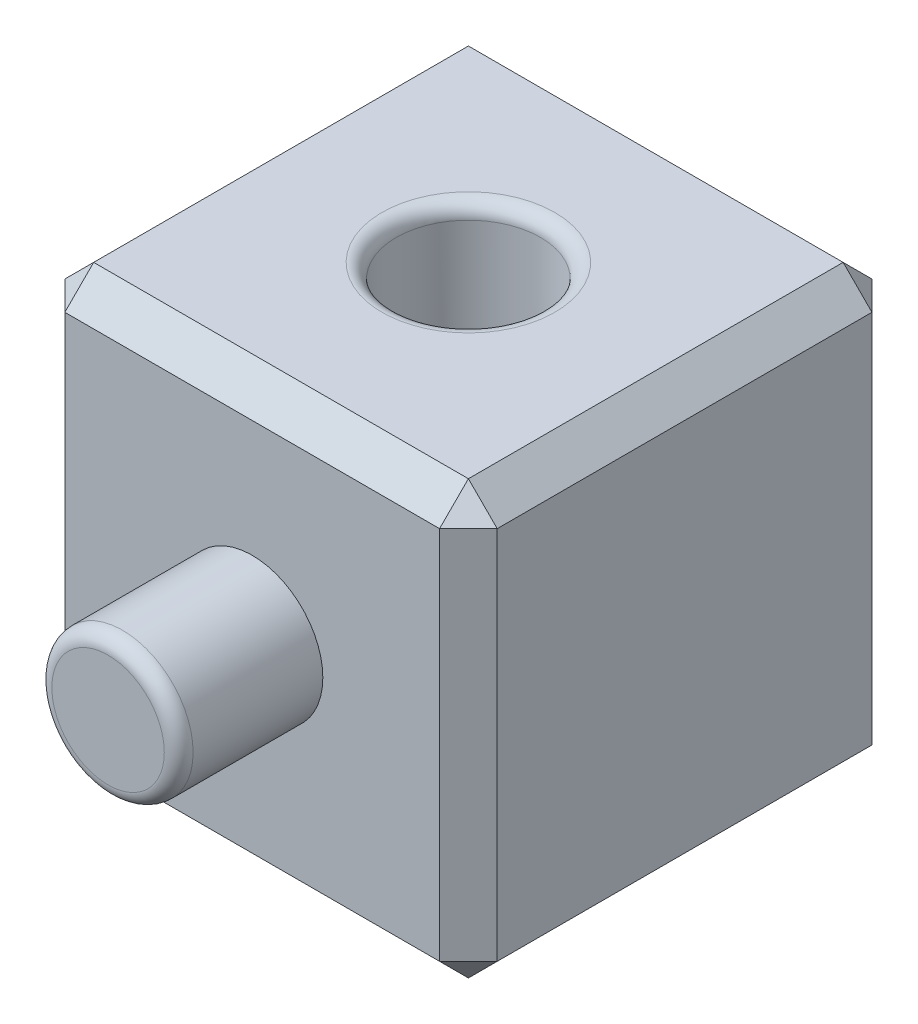
ISO-10303-21;
HEADER;
FILE_DESCRIPTION(('STEP AP214'),'2;1');
FILE_NAME('part.step','',(''),(''),'','','');
FILE_SCHEMA(('AUTOMOTIVE_DESIGN { 1 0 10303 214 1 1 1 1 }'));
ENDSEC;
DATA;
#1=APPLICATION_CONTEXT('core data for automotive mechanical design processes');
#2=APPLICATION_PROTOCOL_DEFINITION('international standard','automotive_design',2000,#1);
#3=PRODUCT_CONTEXT('',#1,'mechanical');
#4=PRODUCT('Part','Part','',(#3));
#5=PRODUCT_RELATED_PRODUCT_CATEGORY('part','',(#4));
#6=PRODUCT_DEFINITION_FORMATION('','',#4);
#7=PRODUCT_DEFINITION_CONTEXT('part definition',#1,'design');
#8=PRODUCT_DEFINITION('design','',#6,#7);
#9=PRODUCT_DEFINITION_SHAPE('','',#8);
#10=(LENGTH_UNIT() NAMED_UNIT(*) SI_UNIT(.MILLI.,.METRE.));
#11=(NAMED_UNIT(*) PLANE_ANGLE_UNIT() SI_UNIT($,.RADIAN.));
#12=(NAMED_UNIT(*) SI_UNIT($,.STERADIAN.) SOLID_ANGLE_UNIT());
#13=UNCERTAINTY_MEASURE_WITH_UNIT(LENGTH_MEASURE(1.E-05),#10,'distance_accuracy_value','');
#14=(GEOMETRIC_REPRESENTATION_CONTEXT(3) GLOBAL_UNCERTAINTY_ASSIGNED_CONTEXT((#13)) GLOBAL_UNIT_ASSIGNED_CONTEXT((#10,
#11,#12)) REPRESENTATION_CONTEXT('',''));
#15=CARTESIAN_POINT('',(0.,0.,0.));
#16=DIRECTION('',(0.,0.,1.));
#17=DIRECTION('',(1.,0.,0.));
#18=AXIS2_PLACEMENT_3D('',#15,#16,#17);
#19=CARTESIAN_POINT('',(0.,0.,15.));
#20=DIRECTION('',(1.,0.,0.));
#21=DIRECTION('',(0.,0.,-1.));
#22=AXIS2_PLACEMENT_3D('',#19,#20,#21);
#23=PLANE('',#22);
#24=CARTESIAN_POINT('',(0.,7.5,7.5));
#25=DIRECTION('',(1.,0.,0.));
#26=DIRECTION('',(0.,0.,-1.));
#27=AXIS2_PLACEMENT_3D('',#24,#25,#26);
#28=CIRCLE('',#27,3.);
#29=CARTESIAN_POINT('',(0.,7.5,4.5));
#30=VERTEX_POINT('',#29);
#31=EDGE_CURVE('E11',#30,#30,#28,.T.);
#32=ORIENTED_EDGE('',*,*,#31,.T.);
#33=EDGE_LOOP('',(#32));
#34=FACE_BOUND('',#33,.T.);
#35=DIRECTION('',(0.,0.,1.));
#36=VECTOR('',#35,1.);
#37=CARTESIAN_POINT('',(0.,0.999999999999997,15.));
#38=LINE('',#37,#36);
#39=CARTESIAN_POINT('',(0.,0.999999999999997,0.999999999999997));
#40=VERTEX_POINT('',#39);
#41=CARTESIAN_POINT('',(0.,0.999999999999997,14.));
#42=VERTEX_POINT('',#41);
#43=EDGE_CURVE('E62',#40,#42,#38,.T.);
#44=ORIENTED_EDGE('',*,*,#43,.T.);
#45=DIRECTION('',(0.,1.,0.));
#46=VECTOR('',#45,1.);
#47=CARTESIAN_POINT('',(0.,0.,14.));
#48=LINE('',#47,#46);
#49=CARTESIAN_POINT('',(0.,14.,14.));
#50=VERTEX_POINT('',#49);
#51=EDGE_CURVE('E237',#42,#50,#48,.T.);
#52=ORIENTED_EDGE('',*,*,#51,.T.);
#53=DIRECTION('',(0.,0.,-1.));
#54=VECTOR('',#53,1.);
#55=CARTESIAN_POINT('',(0.,14.,15.));
#56=LINE('',#55,#54);
#57=CARTESIAN_POINT('',(0.,14.,0.999999999999997));
#58=VERTEX_POINT('',#57);
#59=EDGE_CURVE('E232',#50,#58,#56,.T.);
#60=ORIENTED_EDGE('',*,*,#59,.T.);
#61=DIRECTION('',(0.,-1.,0.));
#62=VECTOR('',#61,1.);
#63=CARTESIAN_POINT('',(0.,0.,0.999999999999997));
#64=LINE('',#63,#62);
#65=EDGE_CURVE('E229',#58,#40,#64,.T.);
#66=ORIENTED_EDGE('',*,*,#65,.T.);
#67=EDGE_LOOP('',(#44,#52,#60,#66));
#68=FACE_BOUND('',#67,.T.);
#69=ADVANCED_FACE('F46',(#34,#68),#23,.F.);
#70=CARTESIAN_POINT('',(0.,0.,15.));
#71=DIRECTION('',(0.,1.,0.));
#72=DIRECTION('',(0.,0.,1.));
#73=AXIS2_PLACEMENT_3D('',#70,#71,#72);
#74=PLANE('',#73);
#75=DIRECTION('',(1.,0.,0.));
#76=VECTOR('',#75,1.);
#77=CARTESIAN_POINT('',(15.,0.,0.999999999999997));
#78=LINE('',#77,#76);
#79=CARTESIAN_POINT('',(1.,0.,0.999999999999997));
#80=VERTEX_POINT('',#79);
#81=CARTESIAN_POINT('',(14.,0.,0.999999999999997));
#82=VERTEX_POINT('',#81);
#83=EDGE_CURVE('E206',#80,#82,#78,.T.);
#84=ORIENTED_EDGE('',*,*,#83,.T.);
#85=DIRECTION('',(0.,0.,1.));
#86=VECTOR('',#85,1.);
#87=CARTESIAN_POINT('',(14.,0.,15.));
#88=LINE('',#87,#86);
#89=CARTESIAN_POINT('',(14.,0.,14.));
#90=VERTEX_POINT('',#89);
#91=EDGE_CURVE('E212',#82,#90,#88,.T.);
#92=ORIENTED_EDGE('',*,*,#91,.T.);
#93=DIRECTION('',(-1.,0.,0.));
#94=VECTOR('',#93,1.);
#95=CARTESIAN_POINT('',(0.,0.,14.));
#96=LINE('',#95,#94);
#97=CARTESIAN_POINT('',(1.,0.,14.));
#98=VERTEX_POINT('',#97);
#99=EDGE_CURVE('E209',#90,#98,#96,.T.);
#100=ORIENTED_EDGE('',*,*,#99,.T.);
#101=DIRECTION('',(0.,0.,-1.));
#102=VECTOR('',#101,1.);
#103=CARTESIAN_POINT('',(1.,0.,15.));
#104=LINE('',#103,#102);
#105=EDGE_CURVE('E203',#98,#80,#104,.T.);
#106=ORIENTED_EDGE('',*,*,#105,.T.);
#107=EDGE_LOOP('',(#84,#92,#100,#106));
#108=FACE_BOUND('',#107,.T.);
#109=ADVANCED_FACE('F359',(#108),#74,.F.);
#110=CARTESIAN_POINT('',(15.,0.,15.));
#111=DIRECTION('',(-1.,0.,0.));
#112=DIRECTION('',(0.,0.,1.));
#113=AXIS2_PLACEMENT_3D('',#110,#111,#112);
#114=PLANE('',#113);
#115=DIRECTION('',(0.,1.,0.));
#116=VECTOR('',#115,1.);
#117=CARTESIAN_POINT('',(15.,15.,0.999999999999997));
#118=LINE('',#117,#116);
#119=CARTESIAN_POINT('',(15.,0.999999999999997,0.999999999999997));
#120=VERTEX_POINT('',#119);
#121=CARTESIAN_POINT('',(15.,14.,0.999999999999997));
#122=VERTEX_POINT('',#121);
#123=EDGE_CURVE('E190',#120,#122,#118,.T.);
#124=ORIENTED_EDGE('',*,*,#123,.T.);
#125=DIRECTION('',(0.,0.,1.));
#126=VECTOR('',#125,1.);
#127=CARTESIAN_POINT('',(15.,14.,15.));
#128=LINE('',#127,#126);
#129=CARTESIAN_POINT('',(15.,14.,14.));
#130=VERTEX_POINT('',#129);
#131=EDGE_CURVE('E199',#122,#130,#128,.T.);
#132=ORIENTED_EDGE('',*,*,#131,.T.);
#133=DIRECTION('',(0.,-1.,0.));
#134=VECTOR('',#133,1.);
#135=CARTESIAN_POINT('',(15.,0.,14.));
#136=LINE('',#135,#134);
#137=CARTESIAN_POINT('',(15.,0.999999999999997,14.));
#138=VERTEX_POINT('',#137);
#139=EDGE_CURVE('E196',#130,#138,#136,.T.);
#140=ORIENTED_EDGE('',*,*,#139,.T.);
#141=DIRECTION('',(0.,0.,-1.));
#142=VECTOR('',#141,1.);
#143=CARTESIAN_POINT('',(15.,0.999999999999997,15.));
#144=LINE('',#143,#142);
#145=EDGE_CURVE('E193',#138,#120,#144,.T.);
#146=ORIENTED_EDGE('',*,*,#145,.T.);
#147=EDGE_LOOP('',(#124,#132,#140,#146));
#148=FACE_BOUND('',#147,.T.);
#149=ADVANCED_FACE('F365',(#148),#114,.F.);
#150=CARTESIAN_POINT('',(0.,15.,15.));
#151=DIRECTION('',(0.,-1.,0.));
#152=DIRECTION('',(0.,0.,-1.));
#153=AXIS2_PLACEMENT_3D('',#150,#151,#152);
#154=PLANE('',#153);
#155=CARTESIAN_POINT('',(7.5,15.,7.5));
#156=DIRECTION('',(0.,-1.,0.));
#157=DIRECTION('',(0.,0.,-1.));
#158=AXIS2_PLACEMENT_3D('',#155,#156,#157);
#159=CIRCLE('',#158,3.);
#160=CARTESIAN_POINT('',(7.5,15.,4.5));
#161=VERTEX_POINT('',#160);
#162=EDGE_CURVE('E331',#161,#161,#159,.T.);
#163=ORIENTED_EDGE('',*,*,#162,.T.);
#164=EDGE_LOOP('',(#163));
#165=FACE_BOUND('',#164,.T.);
#166=DIRECTION('',(0.,0.,1.));
#167=VECTOR('',#166,1.);
#168=CARTESIAN_POINT('',(1.,15.,15.));
#169=LINE('',#168,#167);
#170=CARTESIAN_POINT('',(1.,15.,0.999999999999997));
#171=VERTEX_POINT('',#170);
#172=CARTESIAN_POINT('',(1.,15.,14.));
#173=VERTEX_POINT('',#172);
#174=EDGE_CURVE('E178',#171,#173,#169,.T.);
#175=ORIENTED_EDGE('',*,*,#174,.T.);
#176=DIRECTION('',(1.,0.,0.));
#177=VECTOR('',#176,1.);
#178=CARTESIAN_POINT('',(0.,15.,14.));
#179=LINE('',#178,#177);
#180=CARTESIAN_POINT('',(14.,15.,14.));
#181=VERTEX_POINT('',#180);
#182=EDGE_CURVE('E144',#173,#181,#179,.T.);
#183=ORIENTED_EDGE('',*,*,#182,.T.);
#184=DIRECTION('',(0.,0.,-1.));
#185=VECTOR('',#184,1.);
#186=CARTESIAN_POINT('',(14.,15.,15.));
#187=LINE('',#186,#185);
#188=CARTESIAN_POINT('',(14.,15.,0.999999999999997));
#189=VERTEX_POINT('',#188);
#190=EDGE_CURVE('E185',#181,#189,#187,.T.);
#191=ORIENTED_EDGE('',*,*,#190,.T.);
#192=DIRECTION('',(-1.,0.,0.));
#193=VECTOR('',#192,1.);
#194=CARTESIAN_POINT('',(0.,15.,0.999999999999997));
#195=LINE('',#194,#193);
#196=EDGE_CURVE('E174',#189,#171,#195,.T.);
#197=ORIENTED_EDGE('',*,*,#196,.T.);
#198=EDGE_LOOP('',(#175,#183,#191,#197));
#199=FACE_BOUND('',#198,.T.);
#200=ADVANCED_FACE('F553',(#165,#199),#154,.F.);
#201=CARTESIAN_POINT('',(0.,0.,15.));
#202=DIRECTION('',(0.,0.,-1.));
#203=DIRECTION('',(-1.,0.,0.));
#204=AXIS2_PLACEMENT_3D('',#201,#202,#203);
#205=PLANE('',#204);
#206=DIRECTION('',(0.,1.,0.));
#207=VECTOR('',#206,1.);
#208=CARTESIAN_POINT('',(14.,0.,15.));
#209=LINE('',#208,#207);
#210=CARTESIAN_POINT('',(14.,0.999999999999997,15.));
#211=VERTEX_POINT('',#210);
#212=CARTESIAN_POINT('',(14.,14.,15.));
#213=VERTEX_POINT('',#212);
#214=EDGE_CURVE('E171',#211,#213,#209,.T.);
#215=ORIENTED_EDGE('',*,*,#214,.T.);
#216=DIRECTION('',(-1.,0.,0.));
#217=VECTOR('',#216,1.);
#218=CARTESIAN_POINT('',(0.,14.,15.));
#219=LINE('',#218,#217);
#220=CARTESIAN_POINT('',(1.,14.,15.));
#221=VERTEX_POINT('',#220);
#222=EDGE_CURVE('E142',#213,#221,#219,.T.);
#223=ORIENTED_EDGE('',*,*,#222,.T.);
#224=DIRECTION('',(0.,-1.,0.));
#225=VECTOR('',#224,1.);
#226=CARTESIAN_POINT('',(1.,0.,15.));
#227=LINE('',#226,#225);
#228=CARTESIAN_POINT('',(1.,0.999999999999997,15.));
#229=VERTEX_POINT('',#228);
#230=EDGE_CURVE('E158',#221,#229,#227,.T.);
#231=ORIENTED_EDGE('',*,*,#230,.T.);
#232=DIRECTION('',(1.,0.,0.));
#233=VECTOR('',#232,1.);
#234=CARTESIAN_POINT('',(0.,0.999999999999997,15.));
#235=LINE('',#234,#233);
#236=EDGE_CURVE('E165',#229,#211,#235,.T.);
#237=ORIENTED_EDGE('',*,*,#236,.T.);
#238=EDGE_LOOP('',(#215,#223,#231,#237));
#239=FACE_BOUND('',#238,.T.);
#240=CARTESIAN_POINT('',(7.5,7.5,15.));
#241=DIRECTION('',(0.,0.,1.));
#242=DIRECTION('',(1.,0.,0.));
#243=AXIS2_PLACEMENT_3D('',#240,#241,#242);
#244=CIRCLE('',#243,2.45);
#245=CARTESIAN_POINT('',(9.95,7.5,15.));
#246=VERTEX_POINT('',#245);
#247=EDGE_CURVE('E166',#246,#246,#244,.T.);
#248=ORIENTED_EDGE('',*,*,#247,.F.);
#249=EDGE_LOOP('',(#248));
#250=FACE_BOUND('',#249,.T.);
#251=ADVANCED_FACE('F168',(#239,#250),#205,.F.);
#252=CARTESIAN_POINT('',(0.,0.,0.));
#253=DIRECTION('',(0.,0.,-1.));
#254=DIRECTION('',(-1.,0.,0.));
#255=AXIS2_PLACEMENT_3D('',#252,#253,#254);
#256=PLANE('',#255);
#257=CARTESIAN_POINT('',(7.5,7.5,0.));
#258=DIRECTION('',(0.,0.,-1.));
#259=DIRECTION('',(-1.,0.,0.));
#260=AXIS2_PLACEMENT_3D('',#257,#258,#259);
#261=CIRCLE('',#260,3.);
#262=CARTESIAN_POINT('',(4.5,7.5,0.));
#263=VERTEX_POINT('',#262);
#264=EDGE_CURVE('E339',#263,#263,#261,.F.);
#265=ORIENTED_EDGE('',*,*,#264,.T.);
#266=EDGE_LOOP('',(#265));
#267=FACE_BOUND('',#266,.T.);
#268=DIRECTION('',(1.,0.,0.));
#269=VECTOR('',#268,1.);
#270=CARTESIAN_POINT('',(15.,14.,0.));
#271=LINE('',#270,#269);
#272=CARTESIAN_POINT('',(1.,14.,0.));
#273=VERTEX_POINT('',#272);
#274=CARTESIAN_POINT('',(14.,14.,0.));
#275=VERTEX_POINT('',#274);
#276=EDGE_CURVE('E219',#273,#275,#271,.T.);
#277=ORIENTED_EDGE('',*,*,#276,.T.);
#278=DIRECTION('',(0.,-1.,0.));
#279=VECTOR('',#278,1.);
#280=CARTESIAN_POINT('',(14.,0.,0.));
#281=LINE('',#280,#279);
#282=CARTESIAN_POINT('',(14.,1.,0.));
#283=VERTEX_POINT('',#282);
#284=EDGE_CURVE('E225',#275,#283,#281,.T.);
#285=ORIENTED_EDGE('',*,*,#284,.T.);
#286=DIRECTION('',(-1.,0.,0.));
#287=VECTOR('',#286,1.);
#288=CARTESIAN_POINT('',(0.,1.,0.));
#289=LINE('',#288,#287);
#290=CARTESIAN_POINT('',(1.,1.,0.));
#291=VERTEX_POINT('',#290);
#292=EDGE_CURVE('E222',#283,#291,#289,.T.);
#293=ORIENTED_EDGE('',*,*,#292,.T.);
#294=DIRECTION('',(0.,1.,0.));
#295=VECTOR('',#294,1.);
#296=CARTESIAN_POINT('',(1.,15.,0.));
#297=LINE('',#296,#295);
#298=EDGE_CURVE('E216',#291,#273,#297,.T.);
#299=ORIENTED_EDGE('',*,*,#298,.T.);
#300=EDGE_LOOP('',(#277,#285,#293,#299));
#301=FACE_BOUND('',#300,.T.);
#302=ADVANCED_FACE('F566',(#267,#301),#256,.T.);
#303=CARTESIAN_POINT('',(7.5,7.5,20.));
#304=DIRECTION('',(0.,0.,-1.));
#305=DIRECTION('',(-1.,0.,0.));
#306=AXIS2_PLACEMENT_3D('',#303,#304,#305);
#307=CYLINDRICAL_SURFACE('',#306,2.45);
#308=CARTESIAN_POINT('',(7.5,7.5,19.5));
#309=DIRECTION('',(0.,0.,1.));
#310=DIRECTION('',(1.,0.,0.));
#311=AXIS2_PLACEMENT_3D('',#308,#309,#310);
#312=CIRCLE('',#311,2.45);
#313=CARTESIAN_POINT('',(9.95,7.5,19.5));
#314=VERTEX_POINT('',#313);
#315=EDGE_CURVE('E323',#314,#314,#312,.F.);
#316=ORIENTED_EDGE('',*,*,#315,.T.);
#317=EDGE_LOOP('',(#316));
#318=FACE_BOUND('',#317,.T.);
#319=ORIENTED_EDGE('',*,*,#247,.T.);
#320=EDGE_LOOP('',(#319));
#321=FACE_BOUND('',#320,.T.);
#322=ADVANCED_FACE('F588',(#318,#321),#307,.T.);
#323=CARTESIAN_POINT('',(0.,0.,20.));
#324=DIRECTION('',(0.,0.,1.));
#325=DIRECTION('',(1.,0.,0.));
#326=AXIS2_PLACEMENT_3D('',#323,#324,#325);
#327=PLANE('',#326);
#328=CARTESIAN_POINT('',(7.5,7.5,20.));
#329=DIRECTION('',(0.,0.,1.));
#330=DIRECTION('',(1.,0.,0.));
#331=AXIS2_PLACEMENT_3D('',#328,#329,#330);
#332=CIRCLE('',#331,1.95);
#333=CARTESIAN_POINT('',(9.45,7.5,20.));
#334=VERTEX_POINT('',#333);
#335=EDGE_CURVE('E239',#334,#334,#332,.T.);
#336=ORIENTED_EDGE('',*,*,#335,.T.);
#337=EDGE_LOOP('',(#336));
#338=FACE_BOUND('',#337,.T.);
#339=ADVANCED_FACE('F594',(#338),#327,.T.);
#340=CARTESIAN_POINT('',(4.,7.5,7.5));
#341=DIRECTION('',(-1.,0.,0.));
#342=DIRECTION('',(0.,0.,1.));
#343=AXIS2_PLACEMENT_3D('',#340,#341,#342);
#344=CYLINDRICAL_SURFACE('',#343,2.5);
#345=CARTESIAN_POINT('',(0.5,7.5,7.5));
#346=DIRECTION('',(1.,0.,0.));
#347=DIRECTION('',(0.,0.,-1.));
#348=AXIS2_PLACEMENT_3D('',#345,#346,#347);
#349=CIRCLE('',#348,2.5);
#350=CARTESIAN_POINT('',(0.5,7.5,5.));
#351=VERTEX_POINT('',#350);
#352=EDGE_CURVE('E55',#351,#351,#349,.F.);
#353=ORIENTED_EDGE('',*,*,#352,.T.);
#354=EDGE_LOOP('',(#353));
#355=FACE_BOUND('',#354,.T.);
#356=CARTESIAN_POINT('',(4.,7.5,7.5));
#357=DIRECTION('',(-1.,0.,0.));
#358=DIRECTION('',(0.,0.,1.));
#359=AXIS2_PLACEMENT_3D('',#356,#357,#358);
#360=CIRCLE('',#359,2.5);
#361=CARTESIAN_POINT('',(4.,7.5,10.));
#362=VERTEX_POINT('',#361);
#363=EDGE_CURVE('E528',#362,#362,#360,.T.);
#364=ORIENTED_EDGE('',*,*,#363,.F.);
#365=EDGE_LOOP('',(#364));
#366=FACE_BOUND('',#365,.T.);
#367=ADVANCED_FACE('F346',(#355,#366),#344,.F.);
#368=CARTESIAN_POINT('',(4.,7.5,7.5));
#369=DIRECTION('',(-1.,0.,0.));
#370=DIRECTION('',(0.,0.,1.));
#371=AXIS2_PLACEMENT_3D('',#368,#369,#370);
#372=PLANE('',#371);
#373=ORIENTED_EDGE('',*,*,#363,.T.);
#374=EDGE_LOOP('',(#373));
#375=FACE_BOUND('',#374,.T.);
#376=ADVANCED_FACE('F521',(#375),#372,.T.);
#377=CARTESIAN_POINT('',(7.5,11.,7.5));
#378=DIRECTION('',(0.,1.,0.));
#379=DIRECTION('',(0.,0.,1.));
#380=AXIS2_PLACEMENT_3D('',#377,#378,#379);
#381=CYLINDRICAL_SURFACE('',#380,2.5);
#382=CARTESIAN_POINT('',(7.5,14.5,7.5));
#383=DIRECTION('',(0.,-1.,0.));
#384=DIRECTION('',(0.,0.,-1.));
#385=AXIS2_PLACEMENT_3D('',#382,#383,#384);
#386=CIRCLE('',#385,2.5);
#387=CARTESIAN_POINT('',(7.5,14.5,5.));
#388=VERTEX_POINT('',#387);
#389=EDGE_CURVE('E327',#388,#388,#386,.F.);
#390=ORIENTED_EDGE('',*,*,#389,.T.);
#391=EDGE_LOOP('',(#390));
#392=FACE_BOUND('',#391,.T.);
#393=CARTESIAN_POINT('',(7.5,11.,7.5));
#394=DIRECTION('',(0.,1.,0.));
#395=DIRECTION('',(0.,0.,1.));
#396=AXIS2_PLACEMENT_3D('',#393,#394,#395);
#397=CIRCLE('',#396,2.5);
#398=CARTESIAN_POINT('',(7.5,11.,10.));
#399=VERTEX_POINT('',#398);
#400=EDGE_CURVE('E525',#399,#399,#397,.T.);
#401=ORIENTED_EDGE('',*,*,#400,.F.);
#402=EDGE_LOOP('',(#401));
#403=FACE_BOUND('',#402,.T.);
#404=ADVANCED_FACE('F517',(#392,#403),#381,.F.);
#405=CARTESIAN_POINT('',(7.5,11.,7.5));
#406=DIRECTION('',(0.,1.,0.));
#407=DIRECTION('',(0.,0.,1.));
#408=AXIS2_PLACEMENT_3D('',#405,#406,#407);
#409=PLANE('',#408);
#410=ORIENTED_EDGE('',*,*,#400,.T.);
#411=EDGE_LOOP('',(#410));
#412=FACE_BOUND('',#411,.T.);
#413=ADVANCED_FACE('F520',(#412),#409,.T.);
#414=CARTESIAN_POINT('',(7.5,7.5,4.));
#415=DIRECTION('',(0.,0.,-1.));
#416=DIRECTION('',(-1.,0.,0.));
#417=AXIS2_PLACEMENT_3D('',#414,#415,#416);
#418=CYLINDRICAL_SURFACE('',#417,2.5);
#419=CARTESIAN_POINT('',(7.5,7.5,0.5));
#420=DIRECTION('',(0.,0.,-1.));
#421=DIRECTION('',(-1.,0.,0.));
#422=AXIS2_PLACEMENT_3D('',#419,#420,#421);
#423=CIRCLE('',#422,2.5);
#424=CARTESIAN_POINT('',(5.,7.5,0.5));
#425=VERTEX_POINT('',#424);
#426=EDGE_CURVE('E335',#425,#425,#423,.T.);
#427=ORIENTED_EDGE('',*,*,#426,.T.);
#428=EDGE_LOOP('',(#427));
#429=FACE_BOUND('',#428,.T.);
#430=CARTESIAN_POINT('',(7.5,7.5,4.));
#431=DIRECTION('',(0.,0.,-1.));
#432=DIRECTION('',(-1.,0.,0.));
#433=AXIS2_PLACEMENT_3D('',#430,#431,#432);
#434=CIRCLE('',#433,2.5);
#435=CARTESIAN_POINT('',(5.,7.5,4.));
#436=VERTEX_POINT('',#435);
#437=EDGE_CURVE('E319',#436,#436,#434,.T.);
#438=ORIENTED_EDGE('',*,*,#437,.F.);
#439=EDGE_LOOP('',(#438));
#440=FACE_BOUND('',#439,.T.);
#441=ADVANCED_FACE('F606',(#429,#440),#418,.F.);
#442=CARTESIAN_POINT('',(7.5,7.5,4.));
#443=DIRECTION('',(0.,0.,-1.));
#444=DIRECTION('',(-1.,0.,0.));
#445=AXIS2_PLACEMENT_3D('',#442,#443,#444);
#446=PLANE('',#445);
#447=ORIENTED_EDGE('',*,*,#437,.T.);
#448=EDGE_LOOP('',(#447));
#449=FACE_BOUND('',#448,.T.);
#450=ADVANCED_FACE('F504',(#449),#446,.T.);
#451=CARTESIAN_POINT('',(0.,0.,0.999999999999997));
#452=DIRECTION('',(0.,-0.707106781186546,-0.707106781186549));
#453=DIRECTION('',(-1.,0.,0.));
#454=AXIS2_PLACEMENT_3D('',#451,#452,#453);
#455=PLANE('',#454);
#456=DIRECTION('',(0.,0.707106781186549,-0.707106781186546));
#457=VECTOR('',#456,1.);
#458=CARTESIAN_POINT('',(14.,0.500000000000001,0.499999999999999));
#459=LINE('',#458,#457);
#460=EDGE_CURVE('E315',#82,#283,#459,.T.);
#461=ORIENTED_EDGE('',*,*,#460,.F.);
#462=ORIENTED_EDGE('',*,*,#83,.F.);
#463=DIRECTION('',(0.,-0.707106781186549,0.707106781186546));
#464=VECTOR('',#463,1.);
#465=CARTESIAN_POINT('',(1.,1.,0.));
#466=LINE('',#465,#464);
#467=EDGE_CURVE('E311',#291,#80,#466,.T.);
#468=ORIENTED_EDGE('',*,*,#467,.F.);
#469=ORIENTED_EDGE('',*,*,#292,.F.);
#470=EDGE_LOOP('',(#461,#462,#468,#469));
#471=FACE_BOUND('',#470,.T.);
#472=ADVANCED_FACE('F498',(#471),#455,.T.);
#473=CARTESIAN_POINT('',(15.,0.999999999999997,0.999999999999997));
#474=DIRECTION('',(0.577350269189624,-0.577350269189626,-0.577350269189628));
#475=DIRECTION('',(0.,0.707106781186549,-0.707106781186546));
#476=AXIS2_PLACEMENT_3D('',#473,#474,#475);
#477=PLANE('',#476);
#478=DIRECTION('',(0.707106781186549,0.707106781186546,0.));
#479=VECTOR('',#478,1.);
#480=CARTESIAN_POINT('',(15.,0.999999999999997,0.999999999999997));
#481=LINE('',#480,#479);
#482=EDGE_CURVE('E304',#82,#120,#481,.T.);
#483=ORIENTED_EDGE('',*,*,#482,.F.);
#484=ORIENTED_EDGE('',*,*,#460,.T.);
#485=DIRECTION('',(0.707106781186549,0.,0.707106781186546));
#486=VECTOR('',#485,1.);
#487=CARTESIAN_POINT('',(15.,0.999999999999997,0.999999999999997));
#488=LINE('',#487,#486);
#489=EDGE_CURVE('E308',#120,#283,#488,.F.);
#490=ORIENTED_EDGE('',*,*,#489,.F.);
#491=EDGE_LOOP('',(#483,#484,#490));
#492=FACE_BOUND('',#491,.T.);
#493=ADVANCED_FACE('F491',(#492),#477,.T.);
#494=CARTESIAN_POINT('',(1.,1.,0.));
#495=DIRECTION('',(-0.577350269189624,-0.577350269189626,-0.577350269189628));
#496=DIRECTION('',(0.,0.707106781186549,-0.707106781186546));
#497=AXIS2_PLACEMENT_3D('',#494,#495,#496);
#498=PLANE('',#497);
#499=DIRECTION('',(0.707106781186549,0.,-0.707106781186546));
#500=VECTOR('',#499,1.);
#501=CARTESIAN_POINT('',(1.,1.,0.));
#502=LINE('',#501,#500);
#503=EDGE_CURVE('E296',#291,#40,#502,.F.);
#504=ORIENTED_EDGE('',*,*,#503,.F.);
#505=ORIENTED_EDGE('',*,*,#467,.T.);
#506=DIRECTION('',(0.707106781186549,-0.707106781186546,0.));
#507=VECTOR('',#506,1.);
#508=CARTESIAN_POINT('',(0.500000000000001,0.499999999999999,0.999999999999997));
#509=LINE('',#508,#507);
#510=EDGE_CURVE('E300',#40,#80,#509,.T.);
#511=ORIENTED_EDGE('',*,*,#510,.F.);
#512=EDGE_LOOP('',(#504,#505,#511));
#513=FACE_BOUND('',#512,.T.);
#514=ADVANCED_FACE('F484',(#513),#498,.T.);
#515=CARTESIAN_POINT('',(15.,0.,0.999999999999997));
#516=DIRECTION('',(0.707106781186546,0.,-0.707106781186549));
#517=DIRECTION('',(0.,-1.,0.));
#518=AXIS2_PLACEMENT_3D('',#515,#516,#517);
#519=PLANE('',#518);
#520=ORIENTED_EDGE('',*,*,#489,.T.);
#521=ORIENTED_EDGE('',*,*,#284,.F.);
#522=DIRECTION('',(-0.707106781186549,0.,-0.707106781186546));
#523=VECTOR('',#522,1.);
#524=CARTESIAN_POINT('',(14.5,14.,0.499999999999999));
#525=LINE('',#524,#523);
#526=EDGE_CURVE('E288',#122,#275,#525,.T.);
#527=ORIENTED_EDGE('',*,*,#526,.F.);
#528=ORIENTED_EDGE('',*,*,#123,.F.);
#529=EDGE_LOOP('',(#520,#521,#527,#528));
#530=FACE_BOUND('',#529,.T.);
#531=ADVANCED_FACE('F477',(#530),#519,.T.);
#532=CARTESIAN_POINT('',(15.,0.999999999999997,15.));
#533=DIRECTION('',(-0.707106781186546,0.707106781186549,0.));
#534=DIRECTION('',(0.,0.,-1.));
#535=AXIS2_PLACEMENT_3D('',#532,#533,#534);
#536=PLANE('',#535);
#537=ORIENTED_EDGE('',*,*,#482,.T.);
#538=ORIENTED_EDGE('',*,*,#145,.F.);
#539=DIRECTION('',(-0.707106781186549,-0.707106781186546,0.));
#540=VECTOR('',#539,1.);
#541=CARTESIAN_POINT('',(15.,0.999999999999997,14.));
#542=LINE('',#541,#540);
#543=EDGE_CURVE('E284',#90,#138,#542,.F.);
#544=ORIENTED_EDGE('',*,*,#543,.F.);
#545=ORIENTED_EDGE('',*,*,#91,.F.);
#546=EDGE_LOOP('',(#537,#538,#544,#545));
#547=FACE_BOUND('',#546,.T.);
#548=ADVANCED_FACE('F470',(#547),#536,.F.);
#549=CARTESIAN_POINT('',(0.,0.999999999999997,15.));
#550=DIRECTION('',(0.,0.707106781186549,-0.707106781186546));
#551=DIRECTION('',(1.,0.,0.));
#552=AXIS2_PLACEMENT_3D('',#549,#550,#551);
#553=PLANE('',#552);
#554=DIRECTION('',(0.,-0.707106781186546,-0.707106781186549));
#555=VECTOR('',#554,1.);
#556=CARTESIAN_POINT('',(1.,0.,14.));
#557=LINE('',#556,#555);
#558=EDGE_CURVE('E277',#98,#229,#557,.F.);
#559=ORIENTED_EDGE('',*,*,#558,.F.);
#560=ORIENTED_EDGE('',*,*,#99,.F.);
#561=DIRECTION('',(0.,0.707106781186546,0.707106781186549));
#562=VECTOR('',#561,1.);
#563=CARTESIAN_POINT('',(14.,0.499999999999999,14.5));
#564=LINE('',#563,#562);
#565=EDGE_CURVE('E281',#211,#90,#564,.F.);
#566=ORIENTED_EDGE('',*,*,#565,.F.);
#567=ORIENTED_EDGE('',*,*,#236,.F.);
#568=EDGE_LOOP('',(#559,#560,#566,#567));
#569=FACE_BOUND('',#568,.T.);
#570=ADVANCED_FACE('F463',(#569),#553,.F.);
#571=CARTESIAN_POINT('',(1.,0.,15.));
#572=DIRECTION('',(0.707106781186546,0.707106781186549,0.));
#573=DIRECTION('',(0.,0.,-1.));
#574=AXIS2_PLACEMENT_3D('',#571,#572,#573);
#575=PLANE('',#574);
#576=ORIENTED_EDGE('',*,*,#510,.T.);
#577=ORIENTED_EDGE('',*,*,#105,.F.);
#578=DIRECTION('',(-0.707106781186549,0.707106781186546,0.));
#579=VECTOR('',#578,1.);
#580=CARTESIAN_POINT('',(1.,0.,14.));
#581=LINE('',#580,#579);
#582=EDGE_CURVE('E273',#42,#98,#581,.F.);
#583=ORIENTED_EDGE('',*,*,#582,.F.);
#584=ORIENTED_EDGE('',*,*,#43,.F.);
#585=EDGE_LOOP('',(#576,#577,#583,#584));
#586=FACE_BOUND('',#585,.T.);
#587=ADVANCED_FACE('F456',(#586),#575,.F.);
#588=CARTESIAN_POINT('',(0.,0.,0.999999999999997));
#589=DIRECTION('',(-0.707106781186546,0.,-0.707106781186549));
#590=DIRECTION('',(0.,1.,0.));
#591=AXIS2_PLACEMENT_3D('',#588,#589,#590);
#592=PLANE('',#591);
#593=ORIENTED_EDGE('',*,*,#503,.T.);
#594=ORIENTED_EDGE('',*,*,#65,.F.);
#595=DIRECTION('',(-0.707106781186549,0.,0.707106781186546));
#596=VECTOR('',#595,1.);
#597=CARTESIAN_POINT('',(0.,14.,0.999999999999997));
#598=LINE('',#597,#596);
#599=EDGE_CURVE('E269',#273,#58,#598,.T.);
#600=ORIENTED_EDGE('',*,*,#599,.F.);
#601=ORIENTED_EDGE('',*,*,#298,.F.);
#602=EDGE_LOOP('',(#593,#594,#600,#601));
#603=FACE_BOUND('',#602,.T.);
#604=ADVANCED_FACE('F449',(#603),#592,.T.);
#605=CARTESIAN_POINT('',(0.,15.,0.999999999999997));
#606=DIRECTION('',(0.,0.707106781186546,-0.707106781186549));
#607=DIRECTION('',(1.,0.,0.));
#608=AXIS2_PLACEMENT_3D('',#605,#606,#607);
#609=PLANE('',#608);
#610=DIRECTION('',(0.,0.707106781186549,0.707106781186546));
#611=VECTOR('',#610,1.);
#612=CARTESIAN_POINT('',(14.,15.,0.999999999999997));
#613=LINE('',#612,#611);
#614=EDGE_CURVE('E292',#275,#189,#613,.T.);
#615=ORIENTED_EDGE('',*,*,#614,.F.);
#616=ORIENTED_EDGE('',*,*,#276,.F.);
#617=DIRECTION('',(0.,-0.707106781186549,-0.707106781186546));
#618=VECTOR('',#617,1.);
#619=CARTESIAN_POINT('',(1.,14.5,0.499999999999999));
#620=LINE('',#619,#618);
#621=EDGE_CURVE('E265',#171,#273,#620,.T.);
#622=ORIENTED_EDGE('',*,*,#621,.F.);
#623=ORIENTED_EDGE('',*,*,#196,.F.);
#624=EDGE_LOOP('',(#615,#616,#622,#623));
#625=FACE_BOUND('',#624,.T.);
#626=ADVANCED_FACE('F442',(#625),#609,.T.);
#627=CARTESIAN_POINT('',(14.,15.,0.999999999999997));
#628=DIRECTION('',(0.577350269189626,0.577350269189624,-0.577350269189628));
#629=DIRECTION('',(-0.707106781186549,0.,-0.707106781186546));
#630=AXIS2_PLACEMENT_3D('',#627,#628,#629);
#631=PLANE('',#630);
#632=ORIENTED_EDGE('',*,*,#526,.T.);
#633=ORIENTED_EDGE('',*,*,#614,.T.);
#634=DIRECTION('',(-0.707106781186546,0.707106781186549,0.));
#635=VECTOR('',#634,1.);
#636=CARTESIAN_POINT('',(14.,15.,0.999999999999997));
#637=LINE('',#636,#635);
#638=EDGE_CURVE('E261',#122,#189,#637,.T.);
#639=ORIENTED_EDGE('',*,*,#638,.F.);
#640=EDGE_LOOP('',(#632,#633,#639));
#641=FACE_BOUND('',#640,.T.);
#642=ADVANCED_FACE('F435',(#641),#631,.T.);
#643=CARTESIAN_POINT('',(15.,0.999999999999997,14.));
#644=DIRECTION('',(0.577350269189626,-0.577350269189628,0.577350269189624));
#645=DIRECTION('',(0.707106781186549,0.707106781186546,0.));
#646=AXIS2_PLACEMENT_3D('',#643,#644,#645);
#647=PLANE('',#646);
#648=ORIENTED_EDGE('',*,*,#565,.T.);
#649=ORIENTED_EDGE('',*,*,#543,.T.);
#650=DIRECTION('',(0.707106781186546,0.,-0.707106781186549));
#651=VECTOR('',#650,1.);
#652=CARTESIAN_POINT('',(15.,0.999999999999997,14.));
#653=LINE('',#652,#651);
#654=EDGE_CURVE('E257',#211,#138,#653,.T.);
#655=ORIENTED_EDGE('',*,*,#654,.F.);
#656=EDGE_LOOP('',(#648,#649,#655));
#657=FACE_BOUND('',#656,.T.);
#658=ADVANCED_FACE('F428',(#657),#647,.T.);
#659=CARTESIAN_POINT('',(1.,0.,14.));
#660=DIRECTION('',(-0.577350269189624,-0.577350269189628,0.577350269189626));
#661=DIRECTION('',(0.,-0.707106781186546,-0.707106781186549));
#662=AXIS2_PLACEMENT_3D('',#659,#660,#661);
#663=PLANE('',#662);
#664=ORIENTED_EDGE('',*,*,#582,.T.);
#665=ORIENTED_EDGE('',*,*,#558,.T.);
#666=DIRECTION('',(0.707106781186549,0.,0.707106781186546));
#667=VECTOR('',#666,1.);
#668=CARTESIAN_POINT('',(0.5,0.999999999999997,14.5));
#669=LINE('',#668,#667);
#670=EDGE_CURVE('E161',#42,#229,#669,.T.);
#671=ORIENTED_EDGE('',*,*,#670,.F.);
#672=EDGE_LOOP('',(#664,#665,#671));
#673=FACE_BOUND('',#672,.T.);
#674=ADVANCED_FACE('F421',(#673),#663,.T.);
#675=CARTESIAN_POINT('',(0.,14.,0.999999999999997));
#676=DIRECTION('',(-0.577350269189624,0.577350269189626,-0.577350269189628));
#677=DIRECTION('',(0.,0.707106781186549,0.707106781186546));
#678=AXIS2_PLACEMENT_3D('',#675,#676,#677);
#679=PLANE('',#678);
#680=ORIENTED_EDGE('',*,*,#621,.T.);
#681=ORIENTED_EDGE('',*,*,#599,.T.);
#682=DIRECTION('',(-0.707106781186549,-0.707106781186546,0.));
#683=VECTOR('',#682,1.);
#684=CARTESIAN_POINT('',(0.,14.,0.999999999999997));
#685=LINE('',#684,#683);
#686=EDGE_CURVE('E251',#171,#58,#685,.T.);
#687=ORIENTED_EDGE('',*,*,#686,.F.);
#688=EDGE_LOOP('',(#680,#681,#687));
#689=FACE_BOUND('',#688,.T.);
#690=ADVANCED_FACE('F414',(#689),#679,.T.);
#691=CARTESIAN_POINT('',(14.,15.,15.));
#692=DIRECTION('',(-0.707106781186549,-0.707106781186546,0.));
#693=DIRECTION('',(0.,0.,-1.));
#694=AXIS2_PLACEMENT_3D('',#691,#692,#693);
#695=PLANE('',#694);
#696=ORIENTED_EDGE('',*,*,#638,.T.);
#697=ORIENTED_EDGE('',*,*,#190,.F.);
#698=DIRECTION('',(0.707106781186546,-0.707106781186549,0.));
#699=VECTOR('',#698,1.);
#700=CARTESIAN_POINT('',(14.,15.,14.));
#701=LINE('',#700,#699);
#702=EDGE_CURVE('E247',#130,#181,#701,.F.);
#703=ORIENTED_EDGE('',*,*,#702,.F.);
#704=ORIENTED_EDGE('',*,*,#131,.F.);
#705=EDGE_LOOP('',(#696,#697,#703,#704));
#706=FACE_BOUND('',#705,.T.);
#707=ADVANCED_FACE('F407',(#706),#695,.F.);
#708=CARTESIAN_POINT('',(14.,0.,15.));
#709=DIRECTION('',(-0.707106781186549,0.,-0.707106781186546));
#710=DIRECTION('',(0.,1.,0.));
#711=AXIS2_PLACEMENT_3D('',#708,#709,#710);
#712=PLANE('',#711);
#713=ORIENTED_EDGE('',*,*,#654,.T.);
#714=ORIENTED_EDGE('',*,*,#139,.F.);
#715=DIRECTION('',(-0.707106781186546,0.,0.707106781186549));
#716=VECTOR('',#715,1.);
#717=CARTESIAN_POINT('',(14.5,14.,14.5));
#718=LINE('',#717,#716);
#719=EDGE_CURVE('E155',#213,#130,#718,.F.);
#720=ORIENTED_EDGE('',*,*,#719,.F.);
#721=ORIENTED_EDGE('',*,*,#214,.F.);
#722=EDGE_LOOP('',(#713,#714,#720,#721));
#723=FACE_BOUND('',#722,.T.);
#724=ADVANCED_FACE('F401',(#723),#712,.F.);
#725=CARTESIAN_POINT('',(1.,0.,15.));
#726=DIRECTION('',(0.707106781186546,0.,-0.707106781186549));
#727=DIRECTION('',(0.,-1.,0.));
#728=AXIS2_PLACEMENT_3D('',#725,#726,#727);
#729=PLANE('',#728);
#730=ORIENTED_EDGE('',*,*,#670,.T.);
#731=ORIENTED_EDGE('',*,*,#230,.F.);
#732=DIRECTION('',(-0.707106781186549,0.,-0.707106781186546));
#733=VECTOR('',#732,1.);
#734=CARTESIAN_POINT('',(1.,14.,15.));
#735=LINE('',#734,#733);
#736=EDGE_CURVE('E148',#50,#221,#735,.F.);
#737=ORIENTED_EDGE('',*,*,#736,.F.);
#738=ORIENTED_EDGE('',*,*,#51,.F.);
#739=EDGE_LOOP('',(#730,#731,#737,#738));
#740=FACE_BOUND('',#739,.T.);
#741=ADVANCED_FACE('F159',(#740),#729,.F.);
#742=CARTESIAN_POINT('',(0.,14.,15.));
#743=DIRECTION('',(0.707106781186546,-0.707106781186549,0.));
#744=DIRECTION('',(0.,0.,-1.));
#745=AXIS2_PLACEMENT_3D('',#742,#743,#744);
#746=PLANE('',#745);
#747=ORIENTED_EDGE('',*,*,#686,.T.);
#748=ORIENTED_EDGE('',*,*,#59,.F.);
#749=DIRECTION('',(0.707106781186549,0.707106781186546,0.));
#750=VECTOR('',#749,1.);
#751=CARTESIAN_POINT('',(0.5,14.5,14.));
#752=LINE('',#751,#750);
#753=EDGE_CURVE('E70',#173,#50,#752,.F.);
#754=ORIENTED_EDGE('',*,*,#753,.F.);
#755=ORIENTED_EDGE('',*,*,#174,.F.);
#756=EDGE_LOOP('',(#747,#748,#754,#755));
#757=FACE_BOUND('',#756,.T.);
#758=ADVANCED_FACE('F388',(#757),#746,.F.);
#759=CARTESIAN_POINT('',(14.,15.,14.));
#760=DIRECTION('',(0.577350269189628,0.577350269189626,0.577350269189624));
#761=DIRECTION('',(-0.707106781186546,0.707106781186549,0.));
#762=AXIS2_PLACEMENT_3D('',#759,#760,#761);
#763=PLANE('',#762);
#764=ORIENTED_EDGE('',*,*,#719,.T.);
#765=ORIENTED_EDGE('',*,*,#702,.T.);
#766=DIRECTION('',(0.,0.707106781186546,-0.707106781186549));
#767=VECTOR('',#766,1.);
#768=CARTESIAN_POINT('',(14.,15.,14.));
#769=LINE('',#768,#767);
#770=EDGE_CURVE('E146',#213,#181,#769,.T.);
#771=ORIENTED_EDGE('',*,*,#770,.F.);
#772=EDGE_LOOP('',(#764,#765,#771));
#773=FACE_BOUND('',#772,.T.);
#774=ADVANCED_FACE('F382',(#773),#763,.T.);
#775=CARTESIAN_POINT('',(1.,14.,15.));
#776=DIRECTION('',(-0.577350269189624,0.577350269189628,0.577350269189626));
#777=DIRECTION('',(0.,-0.707106781186546,0.707106781186549));
#778=AXIS2_PLACEMENT_3D('',#775,#776,#777);
#779=PLANE('',#778);
#780=ORIENTED_EDGE('',*,*,#753,.T.);
#781=ORIENTED_EDGE('',*,*,#736,.T.);
#782=DIRECTION('',(0.,-0.707106781186546,0.707106781186549));
#783=VECTOR('',#782,1.);
#784=CARTESIAN_POINT('',(1.,14.,15.));
#785=LINE('',#784,#783);
#786=EDGE_CURVE('E139',#173,#221,#785,.T.);
#787=ORIENTED_EDGE('',*,*,#786,.F.);
#788=EDGE_LOOP('',(#780,#781,#787));
#789=FACE_BOUND('',#788,.T.);
#790=ADVANCED_FACE('F150',(#789),#779,.T.);
#791=CARTESIAN_POINT('',(0.,14.,15.));
#792=DIRECTION('',(0.,-0.707106781186549,-0.707106781186546));
#793=DIRECTION('',(-1.,0.,0.));
#794=AXIS2_PLACEMENT_3D('',#791,#792,#793);
#795=PLANE('',#794);
#796=ORIENTED_EDGE('',*,*,#770,.T.);
#797=ORIENTED_EDGE('',*,*,#182,.F.);
#798=ORIENTED_EDGE('',*,*,#786,.T.);
#799=ORIENTED_EDGE('',*,*,#222,.F.);
#800=EDGE_LOOP('',(#796,#797,#798,#799));
#801=FACE_BOUND('',#800,.T.);
#802=ADVANCED_FACE('F140',(#801),#795,.F.);
#803=CARTESIAN_POINT('',(7.5,7.5,19.5));
#804=DIRECTION('',(0.,0.,1.));
#805=DIRECTION('',(1.,0.,0.));
#806=AXIS2_PLACEMENT_3D('',#803,#804,#805);
#807=TOROIDAL_SURFACE('',#806,1.95,0.5);
#808=ORIENTED_EDGE('',*,*,#315,.F.);
#809=EDGE_LOOP('',(#808));
#810=FACE_BOUND('',#809,.T.);
#811=ORIENTED_EDGE('',*,*,#335,.F.);
#812=EDGE_LOOP('',(#811));
#813=FACE_BOUND('',#812,.T.);
#814=ADVANCED_FACE('F376',(#810,#813),#807,.T.);
#815=CARTESIAN_POINT('',(7.5,14.5,7.5));
#816=DIRECTION('',(0.,-1.,0.));
#817=DIRECTION('',(0.,0.,-1.));
#818=AXIS2_PLACEMENT_3D('',#815,#816,#817);
#819=TOROIDAL_SURFACE('',#818,3.,0.5);
#820=ORIENTED_EDGE('',*,*,#162,.F.);
#821=EDGE_LOOP('',(#820));
#822=FACE_BOUND('',#821,.T.);
#823=ORIENTED_EDGE('',*,*,#389,.F.);
#824=EDGE_LOOP('',(#823));
#825=FACE_BOUND('',#824,.T.);
#826=ADVANCED_FACE('F355',(#822,#825),#819,.T.);
#827=CARTESIAN_POINT('',(7.5,7.5,0.5));
#828=DIRECTION('',(0.,0.,-1.));
#829=DIRECTION('',(-1.,0.,0.));
#830=AXIS2_PLACEMENT_3D('',#827,#828,#829);
#831=TOROIDAL_SURFACE('',#830,3.,0.5);
#832=ORIENTED_EDGE('',*,*,#264,.F.);
#833=EDGE_LOOP('',(#832));
#834=FACE_BOUND('',#833,.T.);
#835=ORIENTED_EDGE('',*,*,#426,.F.);
#836=EDGE_LOOP('',(#835));
#837=FACE_BOUND('',#836,.T.);
#838=ADVANCED_FACE('F350',(#834,#837),#831,.T.);
#839=CARTESIAN_POINT('',(0.5,7.5,7.5));
#840=DIRECTION('',(1.,0.,0.));
#841=DIRECTION('',(0.,0.,-1.));
#842=AXIS2_PLACEMENT_3D('',#839,#840,#841);
#843=TOROIDAL_SURFACE('',#842,3.,0.5);
#844=ORIENTED_EDGE('',*,*,#31,.F.);
#845=EDGE_LOOP('',(#844));
#846=FACE_BOUND('',#845,.T.);
#847=ORIENTED_EDGE('',*,*,#352,.F.);
#848=EDGE_LOOP('',(#847));
#849=FACE_BOUND('',#848,.T.);
#850=ADVANCED_FACE('F48',(#846,#849),#843,.T.);
#851=CLOSED_SHELL('',(#69,#109,#149,#200,#251,#302,#322,#339,#367,#376,#404,#413,#441,#450,#472,
#493,#514,#531,#548,#570,#587,#604,#626,#642,#658,#674,#690,#707,#724,#741,#758,#774,#790,#802,
#814,#826,#838,#850));
#852=MANIFOLD_SOLID_BREP('B2',#851);
#853=ADVANCED_BREP_SHAPE_REPRESENTATION('',(#18,#852),#14);
#854=SHAPE_DEFINITION_REPRESENTATION(#9,#853);
ENDSEC;
END-ISO-10303-21;
